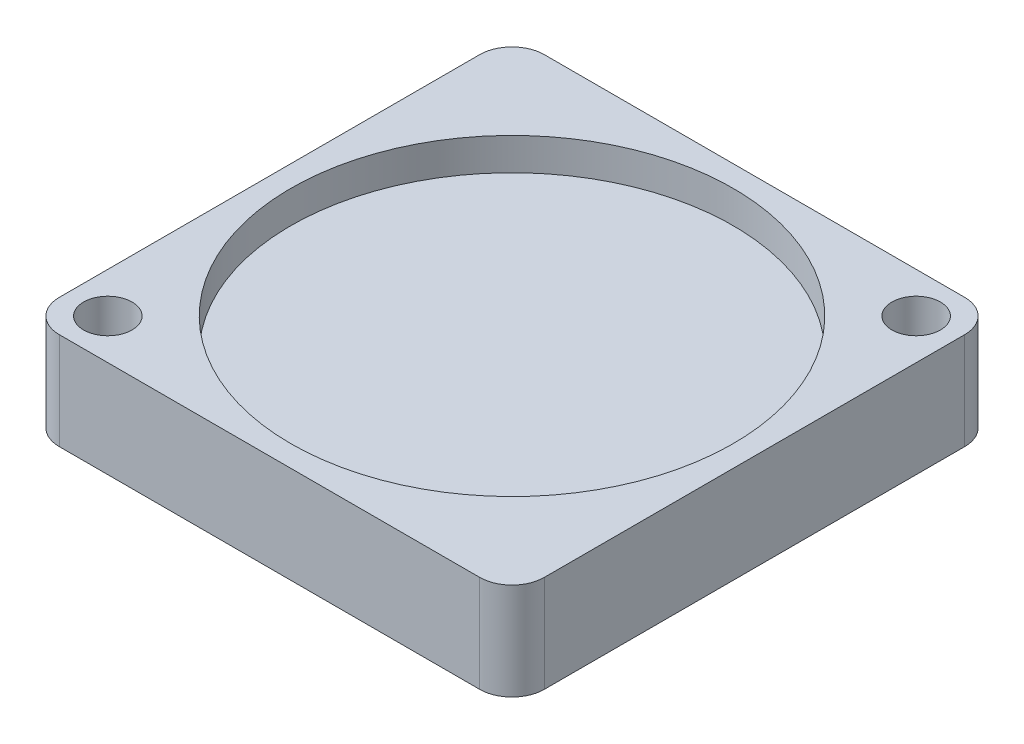
ISO-10303-21;
HEADER;
FILE_DESCRIPTION(('STEP AP214'),'2;1');
FILE_NAME('part.step','',(''),(''),'','','');
FILE_SCHEMA(('AUTOMOTIVE_DESIGN { 1 0 10303 214 1 1 1 1 }'));
ENDSEC;
DATA;
#1=APPLICATION_CONTEXT('core data for automotive mechanical design processes');
#2=APPLICATION_PROTOCOL_DEFINITION('international standard','automotive_design',2000,#1);
#3=PRODUCT_CONTEXT('',#1,'mechanical');
#4=PRODUCT('Part','Part','',(#3));
#5=PRODUCT_RELATED_PRODUCT_CATEGORY('part','',(#4));
#6=PRODUCT_DEFINITION_FORMATION('','',#4);
#7=PRODUCT_DEFINITION_CONTEXT('part definition',#1,'design');
#8=PRODUCT_DEFINITION('design','',#6,#7);
#9=PRODUCT_DEFINITION_SHAPE('','',#8);
#10=(LENGTH_UNIT() NAMED_UNIT(*) SI_UNIT(.MILLI.,.METRE.));
#11=(NAMED_UNIT(*) PLANE_ANGLE_UNIT() SI_UNIT($,.RADIAN.));
#12=(NAMED_UNIT(*) SI_UNIT($,.STERADIAN.) SOLID_ANGLE_UNIT());
#13=UNCERTAINTY_MEASURE_WITH_UNIT(LENGTH_MEASURE(1.E-05),#10,'distance_accuracy_value','');
#14=(GEOMETRIC_REPRESENTATION_CONTEXT(3) GLOBAL_UNCERTAINTY_ASSIGNED_CONTEXT((#13)) GLOBAL_UNIT_ASSIGNED_CONTEXT((#10,
#11,#12)) REPRESENTATION_CONTEXT('',''));
#15=CARTESIAN_POINT('',(0.,0.,0.));
#16=DIRECTION('',(0.,0.,1.));
#17=DIRECTION('',(1.,0.,0.));
#18=AXIS2_PLACEMENT_3D('',#15,#16,#17);
#19=CARTESIAN_POINT('',(-7.5,3.,7.5));
#20=DIRECTION('',(1.,0.,0.));
#21=DIRECTION('',(0.,0.,-1.));
#22=AXIS2_PLACEMENT_3D('',#19,#20,#21);
#23=PLANE('',#22);
#24=DIRECTION('',(0.,0.,1.));
#25=VECTOR('',#24,1.);
#26=CARTESIAN_POINT('',(-7.5,3.,7.5));
#27=LINE('',#26,#25);
#28=CARTESIAN_POINT('',(-7.5,3.,-6.5));
#29=VERTEX_POINT('',#28);
#30=CARTESIAN_POINT('',(-7.5,3.,6.5));
#31=VERTEX_POINT('',#30);
#32=EDGE_CURVE('E122',#29,#31,#27,.T.);
#33=ORIENTED_EDGE('',*,*,#32,.F.);
#34=DIRECTION('',(0.,-1.,0.));
#35=VECTOR('',#34,1.);
#36=CARTESIAN_POINT('',(-7.5,3.,-6.5));
#37=LINE('',#36,#35);
#38=CARTESIAN_POINT('',(-7.5,0.,-6.5));
#39=VERTEX_POINT('',#38);
#40=EDGE_CURVE('E107',#29,#39,#37,.T.);
#41=ORIENTED_EDGE('',*,*,#40,.T.);
#42=DIRECTION('',(0.,0.,1.));
#43=VECTOR('',#42,1.);
#44=CARTESIAN_POINT('',(-7.5,0.,7.5));
#45=LINE('',#44,#43);
#46=CARTESIAN_POINT('',(-7.5,0.,6.5));
#47=VERTEX_POINT('',#46);
#48=EDGE_CURVE('E119',#39,#47,#45,.T.);
#49=ORIENTED_EDGE('',*,*,#48,.T.);
#50=DIRECTION('',(0.,-1.,0.));
#51=VECTOR('',#50,1.);
#52=CARTESIAN_POINT('',(-7.5,3.,6.5));
#53=LINE('',#52,#51);
#54=EDGE_CURVE('E124',#47,#31,#53,.F.);
#55=ORIENTED_EDGE('',*,*,#54,.T.);
#56=EDGE_LOOP('',(#33,#41,#49,#55));
#57=FACE_BOUND('',#56,.T.);
#58=ADVANCED_FACE('F37',(#57),#23,.F.);
#59=CARTESIAN_POINT('',(7.5,3.,7.5));
#60=DIRECTION('',(0.,0.,-1.));
#61=DIRECTION('',(-1.,0.,0.));
#62=AXIS2_PLACEMENT_3D('',#59,#60,#61);
#63=PLANE('',#62);
#64=DIRECTION('',(1.,0.,0.));
#65=VECTOR('',#64,1.);
#66=CARTESIAN_POINT('',(7.5,0.,7.5));
#67=LINE('',#66,#65);
#68=CARTESIAN_POINT('',(-6.5,0.,7.5));
#69=VERTEX_POINT('',#68);
#70=CARTESIAN_POINT('',(6.5,0.,7.5));
#71=VERTEX_POINT('',#70);
#72=EDGE_CURVE('E128',#69,#71,#67,.T.);
#73=ORIENTED_EDGE('',*,*,#72,.T.);
#74=DIRECTION('',(0.,-1.,0.));
#75=VECTOR('',#74,1.);
#76=CARTESIAN_POINT('',(6.5,3.,7.5));
#77=LINE('',#76,#75);
#78=CARTESIAN_POINT('',(6.5,3.,7.5));
#79=VERTEX_POINT('',#78);
#80=EDGE_CURVE('E11',#71,#79,#77,.F.);
#81=ORIENTED_EDGE('',*,*,#80,.T.);
#82=DIRECTION('',(1.,0.,0.));
#83=VECTOR('',#82,1.);
#84=CARTESIAN_POINT('',(7.5,3.,7.5));
#85=LINE('',#84,#83);
#86=CARTESIAN_POINT('',(-6.5,3.,7.5));
#87=VERTEX_POINT('',#86);
#88=EDGE_CURVE('E168',#87,#79,#85,.T.);
#89=ORIENTED_EDGE('',*,*,#88,.F.);
#90=DIRECTION('',(0.,-1.,0.));
#91=VECTOR('',#90,1.);
#92=CARTESIAN_POINT('',(-6.5,3.,7.5));
#93=LINE('',#92,#91);
#94=EDGE_CURVE('E45',#87,#69,#93,.T.);
#95=ORIENTED_EDGE('',*,*,#94,.T.);
#96=EDGE_LOOP('',(#73,#81,#89,#95));
#97=FACE_BOUND('',#96,.T.);
#98=ADVANCED_FACE('F166',(#97),#63,.F.);
#99=CARTESIAN_POINT('',(7.5,3.,7.5));
#100=DIRECTION('',(-1.,0.,0.));
#101=DIRECTION('',(0.,0.,1.));
#102=AXIS2_PLACEMENT_3D('',#99,#100,#101);
#103=PLANE('',#102);
#104=DIRECTION('',(0.,0.,-1.));
#105=VECTOR('',#104,1.);
#106=CARTESIAN_POINT('',(7.5,0.,7.5));
#107=LINE('',#106,#105);
#108=CARTESIAN_POINT('',(7.5,0.,6.5));
#109=VERTEX_POINT('',#108);
#110=CARTESIAN_POINT('',(7.5,0.,-6.5));
#111=VERTEX_POINT('',#110);
#112=EDGE_CURVE('E132',#109,#111,#107,.T.);
#113=ORIENTED_EDGE('',*,*,#112,.T.);
#114=DIRECTION('',(0.,-1.,0.));
#115=VECTOR('',#114,1.);
#116=CARTESIAN_POINT('',(7.5,3.,-6.5));
#117=LINE('',#116,#115);
#118=CARTESIAN_POINT('',(7.5,3.,-6.5));
#119=VERTEX_POINT('',#118);
#120=EDGE_CURVE('E52',#111,#119,#117,.F.);
#121=ORIENTED_EDGE('',*,*,#120,.T.);
#122=DIRECTION('',(0.,0.,-1.));
#123=VECTOR('',#122,1.);
#124=CARTESIAN_POINT('',(7.5,3.,7.5));
#125=LINE('',#124,#123);
#126=CARTESIAN_POINT('',(7.5,3.,6.5));
#127=VERTEX_POINT('',#126);
#128=EDGE_CURVE('E176',#127,#119,#125,.T.);
#129=ORIENTED_EDGE('',*,*,#128,.F.);
#130=DIRECTION('',(0.,-1.,0.));
#131=VECTOR('',#130,1.);
#132=CARTESIAN_POINT('',(7.5,3.,6.5));
#133=LINE('',#132,#131);
#134=EDGE_CURVE('E159',#127,#109,#133,.T.);
#135=ORIENTED_EDGE('',*,*,#134,.T.);
#136=EDGE_LOOP('',(#113,#121,#129,#135));
#137=FACE_BOUND('',#136,.T.);
#138=ADVANCED_FACE('F175',(#137),#103,.F.);
#139=CARTESIAN_POINT('',(7.5,3.,-7.5));
#140=DIRECTION('',(0.,0.,1.));
#141=DIRECTION('',(1.,0.,0.));
#142=AXIS2_PLACEMENT_3D('',#139,#140,#141);
#143=PLANE('',#142);
#144=DIRECTION('',(-1.,0.,0.));
#145=VECTOR('',#144,1.);
#146=CARTESIAN_POINT('',(7.5,0.,-7.5));
#147=LINE('',#146,#145);
#148=CARTESIAN_POINT('',(6.5,0.,-7.5));
#149=VERTEX_POINT('',#148);
#150=CARTESIAN_POINT('',(-6.5,0.,-7.5));
#151=VERTEX_POINT('',#150);
#152=EDGE_CURVE('E142',#149,#151,#147,.T.);
#153=ORIENTED_EDGE('',*,*,#152,.T.);
#154=DIRECTION('',(0.,-1.,0.));
#155=VECTOR('',#154,1.);
#156=CARTESIAN_POINT('',(-6.5,3.,-7.5));
#157=LINE('',#156,#155);
#158=CARTESIAN_POINT('',(-6.5,3.,-7.5));
#159=VERTEX_POINT('',#158);
#160=EDGE_CURVE('E108',#151,#159,#157,.F.);
#161=ORIENTED_EDGE('',*,*,#160,.T.);
#162=DIRECTION('',(-1.,0.,0.));
#163=VECTOR('',#162,1.);
#164=CARTESIAN_POINT('',(7.5,3.,-7.5));
#165=LINE('',#164,#163);
#166=CARTESIAN_POINT('',(6.5,3.,-7.5));
#167=VERTEX_POINT('',#166);
#168=EDGE_CURVE('E138',#167,#159,#165,.T.);
#169=ORIENTED_EDGE('',*,*,#168,.F.);
#170=DIRECTION('',(0.,-1.,0.));
#171=VECTOR('',#170,1.);
#172=CARTESIAN_POINT('',(6.5,3.,-7.5));
#173=LINE('',#172,#171);
#174=EDGE_CURVE('E113',#167,#149,#173,.T.);
#175=ORIENTED_EDGE('',*,*,#174,.T.);
#176=EDGE_LOOP('',(#153,#161,#169,#175));
#177=FACE_BOUND('',#176,.T.);
#178=ADVANCED_FACE('F209',(#177),#143,.F.);
#179=CARTESIAN_POINT('',(0.,3.,0.));
#180=DIRECTION('',(0.,1.,0.));
#181=DIRECTION('',(0.,0.,1.));
#182=AXIS2_PLACEMENT_3D('',#179,#180,#181);
#183=PLANE('',#182);
#184=CARTESIAN_POINT('',(0.,3.,0.));
#185=DIRECTION('',(0.,1.,0.));
#186=DIRECTION('',(0.,0.,1.));
#187=AXIS2_PLACEMENT_3D('',#184,#185,#186);
#188=CIRCLE('',#187,6.83986816654286);
#189=CARTESIAN_POINT('',(0.,3.,6.83986816654286));
#190=VERTEX_POINT('',#189);
#191=EDGE_CURVE('E191',#190,#190,#188,.T.);
#192=ORIENTED_EDGE('',*,*,#191,.F.);
#193=EDGE_LOOP('',(#192));
#194=FACE_BOUND('',#193,.T.);
#195=CARTESIAN_POINT('',(-6.25,3.,6.25));
#196=DIRECTION('',(0.,1.,0.));
#197=DIRECTION('',(0.,0.,1.));
#198=AXIS2_PLACEMENT_3D('',#195,#196,#197);
#199=CIRCLE('',#198,0.75);
#200=CARTESIAN_POINT('',(-6.25,3.,7.));
#201=VERTEX_POINT('',#200);
#202=EDGE_CURVE('E135',#201,#201,#199,.T.);
#203=ORIENTED_EDGE('',*,*,#202,.F.);
#204=EDGE_LOOP('',(#203));
#205=FACE_BOUND('',#204,.T.);
#206=CARTESIAN_POINT('',(6.24999999999993,3.,-6.25000000000007));
#207=DIRECTION('',(0.,1.,0.));
#208=DIRECTION('',(0.,0.,-1.));
#209=AXIS2_PLACEMENT_3D('',#206,#207,#208);
#210=CIRCLE('',#209,0.750000000000001);
#211=CARTESIAN_POINT('',(6.24999999999993,3.,-7.00000000000007));
#212=VERTEX_POINT('',#211);
#213=EDGE_CURVE('E182',#212,#212,#210,.T.);
#214=ORIENTED_EDGE('',*,*,#213,.F.);
#215=EDGE_LOOP('',(#214));
#216=FACE_BOUND('',#215,.T.);
#217=ORIENTED_EDGE('',*,*,#168,.T.);
#218=CARTESIAN_POINT('',(-6.5,3.,-6.5));
#219=DIRECTION('',(0.,1.,0.));
#220=DIRECTION('',(0.,0.,1.));
#221=AXIS2_PLACEMENT_3D('',#218,#219,#220);
#222=CIRCLE('',#221,1.);
#223=EDGE_CURVE('E157',#159,#29,#222,.T.);
#224=ORIENTED_EDGE('',*,*,#223,.T.);
#225=ORIENTED_EDGE('',*,*,#32,.T.);
#226=CARTESIAN_POINT('',(-6.5,3.,6.5));
#227=DIRECTION('',(0.,1.,0.));
#228=DIRECTION('',(0.,0.,1.));
#229=AXIS2_PLACEMENT_3D('',#226,#227,#228);
#230=CIRCLE('',#229,1.);
#231=EDGE_CURVE('E152',#31,#87,#230,.T.);
#232=ORIENTED_EDGE('',*,*,#231,.T.);
#233=ORIENTED_EDGE('',*,*,#88,.T.);
#234=CARTESIAN_POINT('',(6.5,3.,6.5));
#235=DIRECTION('',(0.,1.,0.));
#236=DIRECTION('',(0.,0.,1.));
#237=AXIS2_PLACEMENT_3D('',#234,#235,#236);
#238=CIRCLE('',#237,1.);
#239=EDGE_CURVE('E59',#79,#127,#238,.T.);
#240=ORIENTED_EDGE('',*,*,#239,.T.);
#241=ORIENTED_EDGE('',*,*,#128,.T.);
#242=CARTESIAN_POINT('',(6.5,3.,-6.5));
#243=DIRECTION('',(0.,1.,0.));
#244=DIRECTION('',(0.,0.,1.));
#245=AXIS2_PLACEMENT_3D('',#242,#243,#244);
#246=CIRCLE('',#245,1.);
#247=EDGE_CURVE('E155',#119,#167,#246,.T.);
#248=ORIENTED_EDGE('',*,*,#247,.T.);
#249=EDGE_LOOP('',(#217,#224,#225,#232,#233,#240,#241,#248));
#250=FACE_BOUND('',#249,.T.);
#251=ADVANCED_FACE('F206',(#194,#205,#216,#250),#183,.T.);
#252=CARTESIAN_POINT('',(0.,0.,0.));
#253=DIRECTION('',(0.,1.,0.));
#254=DIRECTION('',(0.,0.,1.));
#255=AXIS2_PLACEMENT_3D('',#252,#253,#254);
#256=PLANE('',#255);
#257=CARTESIAN_POINT('',(-6.25,0.,6.25));
#258=DIRECTION('',(0.,1.,0.));
#259=DIRECTION('',(0.,0.,1.));
#260=AXIS2_PLACEMENT_3D('',#257,#258,#259);
#261=CIRCLE('',#260,0.75);
#262=CARTESIAN_POINT('',(-6.25,0.,7.));
#263=VERTEX_POINT('',#262);
#264=EDGE_CURVE('E129',#263,#263,#261,.T.);
#265=ORIENTED_EDGE('',*,*,#264,.T.);
#266=EDGE_LOOP('',(#265));
#267=FACE_BOUND('',#266,.T.);
#268=CARTESIAN_POINT('',(6.24999999999993,0.,-6.25000000000007));
#269=DIRECTION('',(0.,1.,0.));
#270=DIRECTION('',(0.,0.,-1.));
#271=AXIS2_PLACEMENT_3D('',#268,#269,#270);
#272=CIRCLE('',#271,0.750000000000001);
#273=CARTESIAN_POINT('',(6.24999999999993,0.,-7.00000000000007));
#274=VERTEX_POINT('',#273);
#275=EDGE_CURVE('E185',#274,#274,#272,.T.);
#276=ORIENTED_EDGE('',*,*,#275,.T.);
#277=EDGE_LOOP('',(#276));
#278=FACE_BOUND('',#277,.T.);
#279=ORIENTED_EDGE('',*,*,#48,.F.);
#280=CARTESIAN_POINT('',(-6.5,0.,-6.5));
#281=DIRECTION('',(0.,1.,0.));
#282=DIRECTION('',(0.,0.,1.));
#283=AXIS2_PLACEMENT_3D('',#280,#281,#282);
#284=CIRCLE('',#283,1.);
#285=EDGE_CURVE('E103',#39,#151,#284,.F.);
#286=ORIENTED_EDGE('',*,*,#285,.T.);
#287=ORIENTED_EDGE('',*,*,#152,.F.);
#288=CARTESIAN_POINT('',(6.5,0.,-6.5));
#289=DIRECTION('',(0.,1.,0.));
#290=DIRECTION('',(0.,0.,1.));
#291=AXIS2_PLACEMENT_3D('',#288,#289,#290);
#292=CIRCLE('',#291,1.);
#293=EDGE_CURVE('E114',#149,#111,#292,.F.);
#294=ORIENTED_EDGE('',*,*,#293,.T.);
#295=ORIENTED_EDGE('',*,*,#112,.F.);
#296=CARTESIAN_POINT('',(6.5,0.,6.5));
#297=DIRECTION('',(0.,1.,0.));
#298=DIRECTION('',(0.,0.,1.));
#299=AXIS2_PLACEMENT_3D('',#296,#297,#298);
#300=CIRCLE('',#299,1.);
#301=EDGE_CURVE('E146',#109,#71,#300,.F.);
#302=ORIENTED_EDGE('',*,*,#301,.T.);
#303=ORIENTED_EDGE('',*,*,#72,.F.);
#304=CARTESIAN_POINT('',(-6.5,0.,6.5));
#305=DIRECTION('',(0.,1.,0.));
#306=DIRECTION('',(0.,0.,1.));
#307=AXIS2_PLACEMENT_3D('',#304,#305,#306);
#308=CIRCLE('',#307,1.);
#309=EDGE_CURVE('E123',#69,#47,#308,.F.);
#310=ORIENTED_EDGE('',*,*,#309,.T.);
#311=EDGE_LOOP('',(#279,#286,#287,#294,#295,#302,#303,#310));
#312=FACE_BOUND('',#311,.T.);
#313=ADVANCED_FACE('F126',(#267,#278,#312),#256,.F.);
#314=CARTESIAN_POINT('',(-6.5,3.,-6.5));
#315=DIRECTION('',(0.,-1.,0.));
#316=DIRECTION('',(0.,0.,-1.));
#317=AXIS2_PLACEMENT_3D('',#314,#315,#316);
#318=CYLINDRICAL_SURFACE('',#317,1.);
#319=ORIENTED_EDGE('',*,*,#223,.F.);
#320=ORIENTED_EDGE('',*,*,#160,.F.);
#321=ORIENTED_EDGE('',*,*,#285,.F.);
#322=ORIENTED_EDGE('',*,*,#40,.F.);
#323=EDGE_LOOP('',(#319,#320,#321,#322));
#324=FACE_BOUND('',#323,.T.);
#325=ADVANCED_FACE('F106',(#324),#318,.T.);
#326=CARTESIAN_POINT('',(6.5,3.,-6.5));
#327=DIRECTION('',(0.,-1.,0.));
#328=DIRECTION('',(0.,0.,-1.));
#329=AXIS2_PLACEMENT_3D('',#326,#327,#328);
#330=CYLINDRICAL_SURFACE('',#329,1.);
#331=ORIENTED_EDGE('',*,*,#247,.F.);
#332=ORIENTED_EDGE('',*,*,#120,.F.);
#333=ORIENTED_EDGE('',*,*,#293,.F.);
#334=ORIENTED_EDGE('',*,*,#174,.F.);
#335=EDGE_LOOP('',(#331,#332,#333,#334));
#336=FACE_BOUND('',#335,.T.);
#337=ADVANCED_FACE('F218',(#336),#330,.T.);
#338=CARTESIAN_POINT('',(6.5,3.,6.5));
#339=DIRECTION('',(0.,-1.,0.));
#340=DIRECTION('',(0.,0.,-1.));
#341=AXIS2_PLACEMENT_3D('',#338,#339,#340);
#342=CYLINDRICAL_SURFACE('',#341,1.);
#343=ORIENTED_EDGE('',*,*,#239,.F.);
#344=ORIENTED_EDGE('',*,*,#80,.F.);
#345=ORIENTED_EDGE('',*,*,#301,.F.);
#346=ORIENTED_EDGE('',*,*,#134,.F.);
#347=EDGE_LOOP('',(#343,#344,#345,#346));
#348=FACE_BOUND('',#347,.T.);
#349=ADVANCED_FACE('F174',(#348),#342,.T.);
#350=CARTESIAN_POINT('',(-6.5,3.,6.5));
#351=DIRECTION('',(0.,-1.,0.));
#352=DIRECTION('',(0.,0.,-1.));
#353=AXIS2_PLACEMENT_3D('',#350,#351,#352);
#354=CYLINDRICAL_SURFACE('',#353,1.);
#355=ORIENTED_EDGE('',*,*,#231,.F.);
#356=ORIENTED_EDGE('',*,*,#54,.F.);
#357=ORIENTED_EDGE('',*,*,#309,.F.);
#358=ORIENTED_EDGE('',*,*,#94,.F.);
#359=EDGE_LOOP('',(#355,#356,#357,#358));
#360=FACE_BOUND('',#359,.T.);
#361=ADVANCED_FACE('F39',(#360),#354,.T.);
#362=CARTESIAN_POINT('',(6.24999999999993,0.,-6.25000000000007));
#363=DIRECTION('',(0.,1.,0.));
#364=DIRECTION('',(0.,0.,1.));
#365=AXIS2_PLACEMENT_3D('',#362,#363,#364);
#366=CYLINDRICAL_SURFACE('',#365,0.750000000000001);
#367=ORIENTED_EDGE('',*,*,#275,.F.);
#368=EDGE_LOOP('',(#367));
#369=FACE_BOUND('',#368,.T.);
#370=ORIENTED_EDGE('',*,*,#213,.T.);
#371=EDGE_LOOP('',(#370));
#372=FACE_BOUND('',#371,.T.);
#373=ADVANCED_FACE('F240',(#369,#372),#366,.F.);
#374=CARTESIAN_POINT('',(-6.25,0.,6.25));
#375=DIRECTION('',(0.,1.,0.));
#376=DIRECTION('',(0.,0.,1.));
#377=AXIS2_PLACEMENT_3D('',#374,#375,#376);
#378=CYLINDRICAL_SURFACE('',#377,0.75);
#379=ORIENTED_EDGE('',*,*,#264,.F.);
#380=EDGE_LOOP('',(#379));
#381=FACE_BOUND('',#380,.T.);
#382=ORIENTED_EDGE('',*,*,#202,.T.);
#383=EDGE_LOOP('',(#382));
#384=FACE_BOUND('',#383,.T.);
#385=ADVANCED_FACE('F202',(#381,#384),#378,.F.);
#386=CARTESIAN_POINT('',(0.,2.,0.));
#387=DIRECTION('',(0.,1.,0.));
#388=DIRECTION('',(0.,0.,1.));
#389=AXIS2_PLACEMENT_3D('',#386,#387,#388);
#390=CYLINDRICAL_SURFACE('',#389,6.83986816654286);
#391=CARTESIAN_POINT('',(0.,2.,0.));
#392=DIRECTION('',(0.,1.,0.));
#393=DIRECTION('',(0.,0.,1.));
#394=AXIS2_PLACEMENT_3D('',#391,#392,#393);
#395=CIRCLE('',#394,6.83986816654286);
#396=CARTESIAN_POINT('',(0.,2.,6.83986816654286));
#397=VERTEX_POINT('',#396);
#398=EDGE_CURVE('E186',#397,#397,#395,.T.);
#399=ORIENTED_EDGE('',*,*,#398,.F.);
#400=EDGE_LOOP('',(#399));
#401=FACE_BOUND('',#400,.T.);
#402=ORIENTED_EDGE('',*,*,#191,.T.);
#403=EDGE_LOOP('',(#402));
#404=FACE_BOUND('',#403,.T.);
#405=ADVANCED_FACE('F199',(#401,#404),#390,.F.);
#406=CARTESIAN_POINT('',(0.,2.,0.));
#407=DIRECTION('',(0.,1.,0.));
#408=DIRECTION('',(0.,0.,1.));
#409=AXIS2_PLACEMENT_3D('',#406,#407,#408);
#410=PLANE('',#409);
#411=ORIENTED_EDGE('',*,*,#398,.T.);
#412=EDGE_LOOP('',(#411));
#413=FACE_BOUND('',#412,.T.);
#414=ADVANCED_FACE('F197',(#413),#410,.T.);
#415=CLOSED_SHELL('',(#58,#98,#138,#178,#251,#313,#325,#337,#349,#361,#373,#385,#405,#414));
#416=MANIFOLD_SOLID_BREP('B2',#415);
#417=ADVANCED_BREP_SHAPE_REPRESENTATION('',(#18,#416),#14);
#418=SHAPE_DEFINITION_REPRESENTATION(#9,#417);
ENDSEC;
END-ISO-10303-21;
